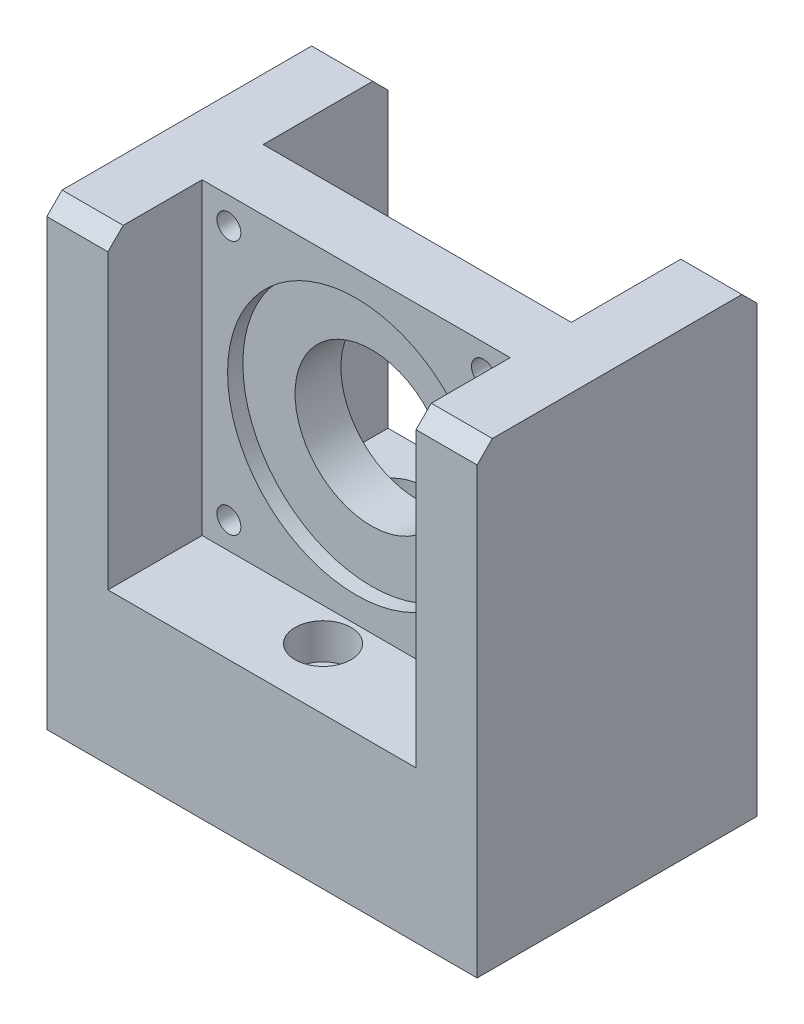
ISO-10303-21;
HEADER;
FILE_DESCRIPTION(('STEP AP214'),'2;1');
FILE_NAME('part.step','',(''),(''),'','','');
FILE_SCHEMA(('AUTOMOTIVE_DESIGN { 1 0 10303 214 1 1 1 1 }'));
ENDSEC;
DATA;
#1=APPLICATION_CONTEXT('core data for automotive mechanical design processes');
#2=APPLICATION_PROTOCOL_DEFINITION('international standard','automotive_design',2000,#1);
#3=PRODUCT_CONTEXT('',#1,'mechanical');
#4=PRODUCT('Part','Part','',(#3));
#5=PRODUCT_RELATED_PRODUCT_CATEGORY('part','',(#4));
#6=PRODUCT_DEFINITION_FORMATION('','',#4);
#7=PRODUCT_DEFINITION_CONTEXT('part definition',#1,'design');
#8=PRODUCT_DEFINITION('design','',#6,#7);
#9=PRODUCT_DEFINITION_SHAPE('','',#8);
#10=(LENGTH_UNIT() NAMED_UNIT(*) SI_UNIT(.MILLI.,.METRE.));
#11=(NAMED_UNIT(*) PLANE_ANGLE_UNIT() SI_UNIT($,.RADIAN.));
#12=(NAMED_UNIT(*) SI_UNIT($,.STERADIAN.) SOLID_ANGLE_UNIT());
#13=UNCERTAINTY_MEASURE_WITH_UNIT(LENGTH_MEASURE(1.E-05),#10,'distance_accuracy_value','');
#14=(GEOMETRIC_REPRESENTATION_CONTEXT(3) GLOBAL_UNCERTAINTY_ASSIGNED_CONTEXT((#13)) GLOBAL_UNIT_ASSIGNED_CONTEXT((#10,
#11,#12)) REPRESENTATION_CONTEXT('',''));
#15=CARTESIAN_POINT('',(0.,0.,0.));
#16=DIRECTION('',(0.,0.,1.));
#17=DIRECTION('',(1.,0.,0.));
#18=AXIS2_PLACEMENT_3D('',#15,#16,#17);
#19=CARTESIAN_POINT('',(17.5,-60.,-18.5));
#20=DIRECTION('',(0.,1.,0.));
#21=DIRECTION('',(-1.,0.,0.));
#22=AXIS2_PLACEMENT_3D('',#19,#20,#21);
#23=CYLINDRICAL_SURFACE('',#22,3.05);
#24=CARTESIAN_POINT('',(17.5,-60.,-18.5));
#25=DIRECTION('',(0.,1.,0.));
#26=DIRECTION('',(1.,0.,0.));
#27=AXIS2_PLACEMENT_3D('',#24,#25,#26);
#28=CIRCLE('',#27,3.05);
#29=CARTESIAN_POINT('',(20.55,-60.,-18.5));
#30=VERTEX_POINT('',#29);
#31=EDGE_CURVE('E300',#30,#30,#28,.T.);
#32=ORIENTED_EDGE('',*,*,#31,.F.);
#33=EDGE_LOOP('',(#32));
#34=FACE_BOUND('',#33,.T.);
#35=CARTESIAN_POINT('',(17.5,-37.25,-18.5));
#36=DIRECTION('',(0.,1.,0.));
#37=DIRECTION('',(-1.,0.,0.));
#38=AXIS2_PLACEMENT_3D('',#35,#36,#37);
#39=CIRCLE('',#38,3.05);
#40=CARTESIAN_POINT('',(14.45,-37.25,-18.5));
#41=VERTEX_POINT('',#40);
#42=EDGE_CURVE('E45',#41,#41,#39,.F.);
#43=ORIENTED_EDGE('',*,*,#42,.F.);
#44=EDGE_LOOP('',(#43));
#45=FACE_BOUND('',#44,.T.);
#46=ADVANCED_FACE('F40',(#34,#45),#23,.F.);
#47=CARTESIAN_POINT('',(-17.5,-60.,-18.5));
#48=DIRECTION('',(0.,1.,0.));
#49=DIRECTION('',(-1.,0.,0.));
#50=AXIS2_PLACEMENT_3D('',#47,#48,#49);
#51=CYLINDRICAL_SURFACE('',#50,3.05);
#52=CARTESIAN_POINT('',(-17.5,-60.,-18.5));
#53=DIRECTION('',(0.,1.,0.));
#54=DIRECTION('',(-1.,0.,0.));
#55=AXIS2_PLACEMENT_3D('',#52,#53,#54);
#56=CIRCLE('',#55,3.05);
#57=CARTESIAN_POINT('',(-20.55,-60.,-18.5));
#58=VERTEX_POINT('',#57);
#59=EDGE_CURVE('E304',#58,#58,#56,.T.);
#60=ORIENTED_EDGE('',*,*,#59,.F.);
#61=EDGE_LOOP('',(#60));
#62=FACE_BOUND('',#61,.T.);
#63=CARTESIAN_POINT('',(-17.5,-37.25,-18.5));
#64=DIRECTION('',(0.,1.,0.));
#65=DIRECTION('',(-1.,0.,0.));
#66=AXIS2_PLACEMENT_3D('',#63,#64,#65);
#67=CIRCLE('',#66,3.05);
#68=CARTESIAN_POINT('',(-20.55,-37.25,-18.5));
#69=VERTEX_POINT('',#68);
#70=EDGE_CURVE('E294',#69,#69,#67,.F.);
#71=ORIENTED_EDGE('',*,*,#70,.F.);
#72=EDGE_LOOP('',(#71));
#73=FACE_BOUND('',#72,.T.);
#74=ADVANCED_FACE('F415',(#62,#73),#51,.F.);
#75=CARTESIAN_POINT('',(0.,-60.,12.5));
#76=DIRECTION('',(0.,1.,0.));
#77=DIRECTION('',(-1.,0.,0.));
#78=AXIS2_PLACEMENT_3D('',#75,#76,#77);
#79=CYLINDRICAL_SURFACE('',#78,3.05);
#80=CARTESIAN_POINT('',(0.,-60.,12.5));
#81=DIRECTION('',(0.,1.,0.));
#82=DIRECTION('',(-1.,0.,0.));
#83=AXIS2_PLACEMENT_3D('',#80,#81,#82);
#84=CIRCLE('',#83,3.05);
#85=CARTESIAN_POINT('',(-3.04999999999999,-60.,12.5));
#86=VERTEX_POINT('',#85);
#87=EDGE_CURVE('E166',#86,#86,#84,.T.);
#88=ORIENTED_EDGE('',*,*,#87,.F.);
#89=EDGE_LOOP('',(#88));
#90=FACE_BOUND('',#89,.T.);
#91=CARTESIAN_POINT('',(0.,-37.25,12.5));
#92=DIRECTION('',(0.,1.,0.));
#93=DIRECTION('',(-1.,0.,0.));
#94=AXIS2_PLACEMENT_3D('',#91,#92,#93);
#95=CIRCLE('',#94,3.05);
#96=CARTESIAN_POINT('',(-3.05,-37.25,12.5));
#97=VERTEX_POINT('',#96);
#98=EDGE_CURVE('E292',#97,#97,#95,.F.);
#99=ORIENTED_EDGE('',*,*,#98,.F.);
#100=EDGE_LOOP('',(#99));
#101=FACE_BOUND('',#100,.T.);
#102=ADVANCED_FACE('F421',(#90,#101),#79,.F.);
#103=CARTESIAN_POINT('',(0.,-30.25,0.));
#104=DIRECTION('',(0.,-1.,0.));
#105=DIRECTION('',(1.,0.,0.));
#106=AXIS2_PLACEMENT_3D('',#103,#104,#105);
#107=PLANE('',#106);
#108=CARTESIAN_POINT('',(0.,-30.25,12.5));
#109=DIRECTION('',(0.,1.,0.));
#110=DIRECTION('',(-1.,0.,0.));
#111=AXIS2_PLACEMENT_3D('',#108,#109,#110);
#112=CIRCLE('',#111,5.5);
#113=CARTESIAN_POINT('',(-5.5,-30.25,12.5));
#114=VERTEX_POINT('',#113);
#115=EDGE_CURVE('E504',#114,#114,#112,.T.);
#116=ORIENTED_EDGE('',*,*,#115,.F.);
#117=EDGE_LOOP('',(#116));
#118=FACE_BOUND('',#117,.T.);
#119=DIRECTION('',(0.,0.,1.));
#120=VECTOR('',#119,1.);
#121=CARTESIAN_POINT('',(-30.25,-30.25,-30.5));
#122=LINE('',#121,#120);
#123=CARTESIAN_POINT('',(-30.25,-30.25,6.));
#124=VERTEX_POINT('',#123);
#125=CARTESIAN_POINT('',(-30.25,-30.25,24.5));
#126=VERTEX_POINT('',#125);
#127=EDGE_CURVE('E165',#124,#126,#122,.T.);
#128=ORIENTED_EDGE('',*,*,#127,.T.);
#129=DIRECTION('',(-1.,0.,0.));
#130=VECTOR('',#129,1.);
#131=CARTESIAN_POINT('',(-42.25,-30.25,24.5));
#132=LINE('',#131,#130);
#133=CARTESIAN_POINT('',(30.25,-30.25,24.5));
#134=VERTEX_POINT('',#133);
#135=EDGE_CURVE('E181',#134,#126,#132,.T.);
#136=ORIENTED_EDGE('',*,*,#135,.F.);
#137=DIRECTION('',(0.,0.,-1.));
#138=VECTOR('',#137,1.);
#139=CARTESIAN_POINT('',(30.25,-30.25,24.5));
#140=LINE('',#139,#138);
#141=CARTESIAN_POINT('',(30.25,-30.25,6.));
#142=VERTEX_POINT('',#141);
#143=EDGE_CURVE('E321',#134,#142,#140,.T.);
#144=ORIENTED_EDGE('',*,*,#143,.T.);
#145=DIRECTION('',(1.,0.,0.));
#146=VECTOR('',#145,1.);
#147=CARTESIAN_POINT('',(30.25,-30.25,6.));
#148=LINE('',#147,#146);
#149=EDGE_CURVE('E242',#124,#142,#148,.T.);
#150=ORIENTED_EDGE('',*,*,#149,.F.);
#151=EDGE_LOOP('',(#128,#136,#144,#150));
#152=FACE_BOUND('',#151,.T.);
#153=ADVANCED_FACE('F383',(#118,#152),#107,.F.);
#154=CARTESIAN_POINT('',(-17.5,-30.25,-18.5));
#155=DIRECTION('',(0.,1.,0.));
#156=DIRECTION('',(-1.,0.,0.));
#157=AXIS2_PLACEMENT_3D('',#154,#155,#156);
#158=CIRCLE('',#157,5.5);
#159=CARTESIAN_POINT('',(-23.,-30.25,-18.5));
#160=VERTEX_POINT('',#159);
#161=EDGE_CURVE('E493',#160,#160,#158,.T.);
#162=ORIENTED_EDGE('',*,*,#161,.F.);
#163=EDGE_LOOP('',(#162));
#164=FACE_BOUND('',#163,.T.);
#165=CARTESIAN_POINT('',(17.5,-30.25,-18.5));
#166=DIRECTION('',(0.,1.,0.));
#167=DIRECTION('',(-1.,0.,0.));
#168=AXIS2_PLACEMENT_3D('',#165,#166,#167);
#169=CIRCLE('',#168,5.5);
#170=CARTESIAN_POINT('',(12.,-30.25,-18.5));
#171=VERTEX_POINT('',#170);
#172=EDGE_CURVE('E496',#171,#171,#169,.T.);
#173=ORIENTED_EDGE('',*,*,#172,.F.);
#174=EDGE_LOOP('',(#173));
#175=FACE_BOUND('',#174,.T.);
#176=CARTESIAN_POINT('',(-30.25,-30.25,-30.5));
#177=VERTEX_POINT('',#176);
#178=CARTESIAN_POINT('',(-30.25,-30.25,-6.));
#179=VERTEX_POINT('',#178);
#180=EDGE_CURVE('E169',#177,#179,#122,.T.);
#181=ORIENTED_EDGE('',*,*,#180,.T.);
#182=DIRECTION('',(1.,0.,0.));
#183=VECTOR('',#182,1.);
#184=CARTESIAN_POINT('',(30.25,-30.25,-6.));
#185=LINE('',#184,#183);
#186=CARTESIAN_POINT('',(30.25,-30.25,-6.));
#187=VERTEX_POINT('',#186);
#188=EDGE_CURVE('E254',#179,#187,#185,.T.);
#189=ORIENTED_EDGE('',*,*,#188,.T.);
#190=CARTESIAN_POINT('',(30.25,-30.25,-30.5));
#191=VERTEX_POINT('',#190);
#192=EDGE_CURVE('E180',#187,#191,#140,.T.);
#193=ORIENTED_EDGE('',*,*,#192,.T.);
#194=DIRECTION('',(1.,0.,0.));
#195=VECTOR('',#194,1.);
#196=CARTESIAN_POINT('',(-42.25,-30.25,-30.5));
#197=LINE('',#196,#195);
#198=EDGE_CURVE('E160',#177,#191,#197,.T.);
#199=ORIENTED_EDGE('',*,*,#198,.F.);
#200=EDGE_LOOP('',(#181,#189,#193,#199));
#201=FACE_BOUND('',#200,.T.);
#202=ADVANCED_FACE('F179',(#164,#175,#201),#107,.F.);
#203=CARTESIAN_POINT('',(0.,0.,6.));
#204=DIRECTION('',(0.,0.,-1.));
#205=DIRECTION('',(-1.,0.,0.));
#206=AXIS2_PLACEMENT_3D('',#203,#204,#205);
#207=CYLINDRICAL_SURFACE('',#206,15.);
#208=CARTESIAN_POINT('',(0.,0.,-6.));
#209=DIRECTION('',(0.,0.,1.));
#210=DIRECTION('',(1.,0.,0.));
#211=AXIS2_PLACEMENT_3D('',#208,#209,#210);
#212=CIRCLE('',#211,15.);
#213=CARTESIAN_POINT('',(15.,0.,-6.));
#214=VERTEX_POINT('',#213);
#215=EDGE_CURVE('E234',#214,#214,#212,.T.);
#216=ORIENTED_EDGE('',*,*,#215,.F.);
#217=EDGE_LOOP('',(#216));
#218=FACE_BOUND('',#217,.T.);
#219=CARTESIAN_POINT('',(0.,0.,3.));
#220=DIRECTION('',(0.,0.,1.));
#221=DIRECTION('',(1.,0.,0.));
#222=AXIS2_PLACEMENT_3D('',#219,#220,#221);
#223=CIRCLE('',#222,15.);
#224=CARTESIAN_POINT('',(15.,0.,3.));
#225=VERTEX_POINT('',#224);
#226=EDGE_CURVE('E209',#225,#225,#223,.T.);
#227=ORIENTED_EDGE('',*,*,#226,.T.);
#228=EDGE_LOOP('',(#227));
#229=FACE_BOUND('',#228,.T.);
#230=ADVANCED_FACE('F392',(#218,#229),#207,.F.);
#231=CARTESIAN_POINT('',(0.,0.,6.));
#232=DIRECTION('',(0.,0.,1.));
#233=DIRECTION('',(1.,0.,0.));
#234=AXIS2_PLACEMENT_3D('',#231,#232,#233);
#235=PLANE('',#234);
#236=CARTESIAN_POINT('',(0.,0.,6.));
#237=DIRECTION('',(0.,0.,1.));
#238=DIRECTION('',(1.,0.,0.));
#239=AXIS2_PLACEMENT_3D('',#236,#237,#238);
#240=CIRCLE('',#239,25.25);
#241=CARTESIAN_POINT('',(25.25,0.,6.));
#242=VERTEX_POINT('',#241);
#243=EDGE_CURVE('E205',#242,#242,#240,.T.);
#244=ORIENTED_EDGE('',*,*,#243,.F.);
#245=EDGE_LOOP('',(#244));
#246=FACE_BOUND('',#245,.T.);
#247=CARTESIAN_POINT('',(25.,-25.,6.));
#248=DIRECTION('',(0.,0.,1.));
#249=DIRECTION('',(1.,0.,0.));
#250=AXIS2_PLACEMENT_3D('',#247,#248,#249);
#251=CIRCLE('',#250,2.35);
#252=CARTESIAN_POINT('',(27.35,-25.,6.));
#253=VERTEX_POINT('',#252);
#254=EDGE_CURVE('E219',#253,#253,#251,.T.);
#255=ORIENTED_EDGE('',*,*,#254,.F.);
#256=EDGE_LOOP('',(#255));
#257=FACE_BOUND('',#256,.T.);
#258=CARTESIAN_POINT('',(-25.,25.,6.));
#259=DIRECTION('',(0.,0.,1.));
#260=DIRECTION('',(1.,0.,0.));
#261=AXIS2_PLACEMENT_3D('',#258,#259,#260);
#262=CIRCLE('',#261,2.35);
#263=CARTESIAN_POINT('',(-22.65,25.,6.));
#264=VERTEX_POINT('',#263);
#265=EDGE_CURVE('E231',#264,#264,#262,.T.);
#266=ORIENTED_EDGE('',*,*,#265,.F.);
#267=EDGE_LOOP('',(#266));
#268=FACE_BOUND('',#267,.T.);
#269=DIRECTION('',(0.,-1.,0.));
#270=VECTOR('',#269,1.);
#271=CARTESIAN_POINT('',(-30.25,-30.25,6.));
#272=LINE('',#271,#270);
#273=CARTESIAN_POINT('',(-30.25,30.25,6.));
#274=VERTEX_POINT('',#273);
#275=EDGE_CURVE('E239',#274,#124,#272,.T.);
#276=ORIENTED_EDGE('',*,*,#275,.T.);
#277=ORIENTED_EDGE('',*,*,#149,.T.);
#278=DIRECTION('',(0.,1.,0.));
#279=VECTOR('',#278,1.);
#280=CARTESIAN_POINT('',(30.25,-30.25,6.));
#281=LINE('',#280,#279);
#282=CARTESIAN_POINT('',(30.25,30.25,6.));
#283=VERTEX_POINT('',#282);
#284=EDGE_CURVE('E246',#142,#283,#281,.T.);
#285=ORIENTED_EDGE('',*,*,#284,.T.);
#286=DIRECTION('',(-1.,0.,0.));
#287=VECTOR('',#286,1.);
#288=CARTESIAN_POINT('',(30.25,30.25,6.));
#289=LINE('',#288,#287);
#290=EDGE_CURVE('E249',#283,#274,#289,.T.);
#291=ORIENTED_EDGE('',*,*,#290,.T.);
#292=EDGE_LOOP('',(#276,#277,#285,#291));
#293=FACE_BOUND('',#292,.T.);
#294=CARTESIAN_POINT('',(25.,25.,6.));
#295=DIRECTION('',(0.,0.,1.));
#296=DIRECTION('',(1.,0.,0.));
#297=AXIS2_PLACEMENT_3D('',#294,#295,#296);
#298=CIRCLE('',#297,2.35);
#299=CARTESIAN_POINT('',(27.35,25.,6.));
#300=VERTEX_POINT('',#299);
#301=EDGE_CURVE('E225',#300,#300,#298,.T.);
#302=ORIENTED_EDGE('',*,*,#301,.F.);
#303=EDGE_LOOP('',(#302));
#304=FACE_BOUND('',#303,.T.);
#305=CARTESIAN_POINT('',(-25.,-25.,6.));
#306=DIRECTION('',(0.,0.,1.));
#307=DIRECTION('',(1.,0.,0.));
#308=AXIS2_PLACEMENT_3D('',#305,#306,#307);
#309=CIRCLE('',#308,2.35);
#310=CARTESIAN_POINT('',(-22.65,-25.,6.));
#311=VERTEX_POINT('',#310);
#312=EDGE_CURVE('E212',#311,#311,#309,.T.);
#313=ORIENTED_EDGE('',*,*,#312,.F.);
#314=EDGE_LOOP('',(#313));
#315=FACE_BOUND('',#314,.T.);
#316=ADVANCED_FACE('F389',(#246,#257,#268,#293,#304,#315),#235,.T.);
#317=CARTESIAN_POINT('',(0.,0.,-6.));
#318=DIRECTION('',(0.,0.,1.));
#319=DIRECTION('',(1.,0.,0.));
#320=AXIS2_PLACEMENT_3D('',#317,#318,#319);
#321=PLANE('',#320);
#322=DIRECTION('',(0.,-1.,0.));
#323=VECTOR('',#322,1.);
#324=CARTESIAN_POINT('',(-30.25,-30.25,-6.));
#325=LINE('',#324,#323);
#326=CARTESIAN_POINT('',(-30.25,30.25,-6.));
#327=VERTEX_POINT('',#326);
#328=EDGE_CURVE('E172',#327,#179,#325,.T.);
#329=ORIENTED_EDGE('',*,*,#328,.F.);
#330=DIRECTION('',(-1.,0.,0.));
#331=VECTOR('',#330,1.);
#332=CARTESIAN_POINT('',(30.25,30.25,-6.));
#333=LINE('',#332,#331);
#334=CARTESIAN_POINT('',(30.25,30.25,-6.));
#335=VERTEX_POINT('',#334);
#336=EDGE_CURVE('E243',#335,#327,#333,.T.);
#337=ORIENTED_EDGE('',*,*,#336,.F.);
#338=DIRECTION('',(0.,1.,0.));
#339=VECTOR('',#338,1.);
#340=CARTESIAN_POINT('',(30.25,-30.25,-6.));
#341=LINE('',#340,#339);
#342=EDGE_CURVE('E256',#187,#335,#341,.T.);
#343=ORIENTED_EDGE('',*,*,#342,.F.);
#344=ORIENTED_EDGE('',*,*,#188,.F.);
#345=EDGE_LOOP('',(#329,#337,#343,#344));
#346=FACE_BOUND('',#345,.T.);
#347=ORIENTED_EDGE('',*,*,#215,.T.);
#348=EDGE_LOOP('',(#347));
#349=FACE_BOUND('',#348,.T.);
#350=CARTESIAN_POINT('',(-25.,25.,-6.));
#351=DIRECTION('',(0.,0.,1.));
#352=DIRECTION('',(1.,0.,0.));
#353=AXIS2_PLACEMENT_3D('',#350,#351,#352);
#354=CIRCLE('',#353,2.35);
#355=CARTESIAN_POINT('',(-22.65,25.,-6.));
#356=VERTEX_POINT('',#355);
#357=EDGE_CURVE('E228',#356,#356,#354,.T.);
#358=ORIENTED_EDGE('',*,*,#357,.T.);
#359=EDGE_LOOP('',(#358));
#360=FACE_BOUND('',#359,.T.);
#361=CARTESIAN_POINT('',(25.,25.,-6.));
#362=DIRECTION('',(0.,0.,1.));
#363=DIRECTION('',(1.,0.,0.));
#364=AXIS2_PLACEMENT_3D('',#361,#362,#363);
#365=CIRCLE('',#364,2.35);
#366=CARTESIAN_POINT('',(27.35,25.,-6.));
#367=VERTEX_POINT('',#366);
#368=EDGE_CURVE('E222',#367,#367,#365,.T.);
#369=ORIENTED_EDGE('',*,*,#368,.T.);
#370=EDGE_LOOP('',(#369));
#371=FACE_BOUND('',#370,.T.);
#372=CARTESIAN_POINT('',(25.,-25.,-6.));
#373=DIRECTION('',(0.,0.,1.));
#374=DIRECTION('',(1.,0.,0.));
#375=AXIS2_PLACEMENT_3D('',#372,#373,#374);
#376=CIRCLE('',#375,2.35);
#377=CARTESIAN_POINT('',(27.35,-25.,-6.));
#378=VERTEX_POINT('',#377);
#379=EDGE_CURVE('E215',#378,#378,#376,.T.);
#380=ORIENTED_EDGE('',*,*,#379,.T.);
#381=EDGE_LOOP('',(#380));
#382=FACE_BOUND('',#381,.T.);
#383=CARTESIAN_POINT('',(-25.,-25.,-6.));
#384=DIRECTION('',(0.,0.,1.));
#385=DIRECTION('',(1.,0.,0.));
#386=AXIS2_PLACEMENT_3D('',#383,#384,#385);
#387=CIRCLE('',#386,2.35);
#388=CARTESIAN_POINT('',(-22.65,-25.,-6.));
#389=VERTEX_POINT('',#388);
#390=EDGE_CURVE('E216',#389,#389,#387,.T.);
#391=ORIENTED_EDGE('',*,*,#390,.T.);
#392=EDGE_LOOP('',(#391));
#393=FACE_BOUND('',#392,.T.);
#394=ADVANCED_FACE('F359',(#346,#349,#360,#371,#382,#393),#321,.F.);
#395=CARTESIAN_POINT('',(30.25,30.25,6.));
#396=DIRECTION('',(0.,-1.,0.));
#397=DIRECTION('',(1.,0.,0.));
#398=AXIS2_PLACEMENT_3D('',#395,#396,#397);
#399=PLANE('',#398);
#400=DIRECTION('',(0.,0.,-1.));
#401=VECTOR('',#400,1.);
#402=CARTESIAN_POINT('',(-30.25,30.25,-30.5));
#403=LINE('',#402,#401);
#404=CARTESIAN_POINT('',(-30.25,30.25,-27.5));
#405=VERTEX_POINT('',#404);
#406=EDGE_CURVE('E318',#327,#405,#403,.T.);
#407=ORIENTED_EDGE('',*,*,#406,.T.);
#408=DIRECTION('',(-1.,0.,0.));
#409=VECTOR('',#408,1.);
#410=CARTESIAN_POINT('',(30.25,30.25,-27.5));
#411=LINE('',#410,#409);
#412=CARTESIAN_POINT('',(-42.25,30.25,-27.5));
#413=VERTEX_POINT('',#412);
#414=EDGE_CURVE('E275',#405,#413,#411,.T.);
#415=ORIENTED_EDGE('',*,*,#414,.T.);
#416=DIRECTION('',(0.,0.,-1.));
#417=VECTOR('',#416,1.);
#418=CARTESIAN_POINT('',(-42.25,30.25,-30.5));
#419=LINE('',#418,#417);
#420=CARTESIAN_POINT('',(-42.25,30.25,21.5));
#421=VERTEX_POINT('',#420);
#422=EDGE_CURVE('E312',#421,#413,#419,.T.);
#423=ORIENTED_EDGE('',*,*,#422,.F.);
#424=DIRECTION('',(1.,0.,0.));
#425=VECTOR('',#424,1.);
#426=CARTESIAN_POINT('',(30.25,30.25,21.5));
#427=LINE('',#426,#425);
#428=CARTESIAN_POINT('',(-30.25,30.25,21.5));
#429=VERTEX_POINT('',#428);
#430=EDGE_CURVE('E267',#421,#429,#427,.T.);
#431=ORIENTED_EDGE('',*,*,#430,.T.);
#432=EDGE_CURVE('E315',#429,#274,#403,.T.);
#433=ORIENTED_EDGE('',*,*,#432,.T.);
#434=ORIENTED_EDGE('',*,*,#290,.F.);
#435=DIRECTION('',(0.,0.,1.));
#436=VECTOR('',#435,1.);
#437=CARTESIAN_POINT('',(30.25,30.25,24.5));
#438=LINE('',#437,#436);
#439=CARTESIAN_POINT('',(30.25,30.25,21.5));
#440=VERTEX_POINT('',#439);
#441=EDGE_CURVE('E326',#283,#440,#438,.T.);
#442=ORIENTED_EDGE('',*,*,#441,.T.);
#443=DIRECTION('',(1.,0.,0.));
#444=VECTOR('',#443,1.);
#445=CARTESIAN_POINT('',(30.25,30.25,21.5));
#446=LINE('',#445,#444);
#447=CARTESIAN_POINT('',(42.25,30.25,21.5));
#448=VERTEX_POINT('',#447);
#449=EDGE_CURVE('E270',#440,#448,#446,.T.);
#450=ORIENTED_EDGE('',*,*,#449,.T.);
#451=DIRECTION('',(0.,0.,1.));
#452=VECTOR('',#451,1.);
#453=CARTESIAN_POINT('',(42.25,30.25,24.5));
#454=LINE('',#453,#452);
#455=CARTESIAN_POINT('',(42.25,30.25,-27.5));
#456=VERTEX_POINT('',#455);
#457=EDGE_CURVE('E182',#456,#448,#454,.T.);
#458=ORIENTED_EDGE('',*,*,#457,.F.);
#459=DIRECTION('',(-1.,0.,0.));
#460=VECTOR('',#459,1.);
#461=CARTESIAN_POINT('',(30.25,30.25,-27.5));
#462=LINE('',#461,#460);
#463=CARTESIAN_POINT('',(30.25,30.25,-27.5));
#464=VERTEX_POINT('',#463);
#465=EDGE_CURVE('E272',#456,#464,#462,.T.);
#466=ORIENTED_EDGE('',*,*,#465,.T.);
#467=EDGE_CURVE('E188',#464,#335,#438,.T.);
#468=ORIENTED_EDGE('',*,*,#467,.T.);
#469=ORIENTED_EDGE('',*,*,#336,.T.);
#470=EDGE_LOOP('',(#407,#415,#423,#431,#433,#434,#442,#450,#458,#466,#468,#469));
#471=FACE_BOUND('',#470,.T.);
#472=ADVANCED_FACE('F353',(#471),#399,.F.);
#473=CARTESIAN_POINT('',(-25.,25.,6.));
#474=DIRECTION('',(0.,0.,-1.));
#475=DIRECTION('',(-1.,0.,0.));
#476=AXIS2_PLACEMENT_3D('',#473,#474,#475);
#477=CYLINDRICAL_SURFACE('',#476,2.35);
#478=ORIENTED_EDGE('',*,*,#265,.T.);
#479=EDGE_LOOP('',(#478));
#480=FACE_BOUND('',#479,.T.);
#481=ORIENTED_EDGE('',*,*,#357,.F.);
#482=EDGE_LOOP('',(#481));
#483=FACE_BOUND('',#482,.T.);
#484=ADVANCED_FACE('F412',(#480,#483),#477,.F.);
#485=CARTESIAN_POINT('',(25.,25.,6.));
#486=DIRECTION('',(0.,0.,-1.));
#487=DIRECTION('',(-1.,0.,0.));
#488=AXIS2_PLACEMENT_3D('',#485,#486,#487);
#489=CYLINDRICAL_SURFACE('',#488,2.35);
#490=ORIENTED_EDGE('',*,*,#301,.T.);
#491=EDGE_LOOP('',(#490));
#492=FACE_BOUND('',#491,.T.);
#493=ORIENTED_EDGE('',*,*,#368,.F.);
#494=EDGE_LOOP('',(#493));
#495=FACE_BOUND('',#494,.T.);
#496=ADVANCED_FACE('F454',(#492,#495),#489,.F.);
#497=CARTESIAN_POINT('',(25.,-25.,6.));
#498=DIRECTION('',(0.,0.,-1.));
#499=DIRECTION('',(-1.,0.,0.));
#500=AXIS2_PLACEMENT_3D('',#497,#498,#499);
#501=CYLINDRICAL_SURFACE('',#500,2.35);
#502=ORIENTED_EDGE('',*,*,#254,.T.);
#503=EDGE_LOOP('',(#502));
#504=FACE_BOUND('',#503,.T.);
#505=ORIENTED_EDGE('',*,*,#379,.F.);
#506=EDGE_LOOP('',(#505));
#507=FACE_BOUND('',#506,.T.);
#508=ADVANCED_FACE('F403',(#504,#507),#501,.F.);
#509=CARTESIAN_POINT('',(-25.,-25.,6.));
#510=DIRECTION('',(0.,0.,-1.));
#511=DIRECTION('',(-1.,0.,0.));
#512=AXIS2_PLACEMENT_3D('',#509,#510,#511);
#513=CYLINDRICAL_SURFACE('',#512,2.35);
#514=ORIENTED_EDGE('',*,*,#312,.T.);
#515=EDGE_LOOP('',(#514));
#516=FACE_BOUND('',#515,.T.);
#517=ORIENTED_EDGE('',*,*,#390,.F.);
#518=EDGE_LOOP('',(#517));
#519=FACE_BOUND('',#518,.T.);
#520=ADVANCED_FACE('F399',(#516,#519),#513,.F.);
#521=CARTESIAN_POINT('',(0.,0.,3.));
#522=DIRECTION('',(0.,0.,1.));
#523=DIRECTION('',(1.,0.,0.));
#524=AXIS2_PLACEMENT_3D('',#521,#522,#523);
#525=CYLINDRICAL_SURFACE('',#524,25.25);
#526=CARTESIAN_POINT('',(0.,0.,3.));
#527=DIRECTION('',(0.,0.,1.));
#528=DIRECTION('',(1.,0.,0.));
#529=AXIS2_PLACEMENT_3D('',#526,#527,#528);
#530=CIRCLE('',#529,25.25);
#531=CARTESIAN_POINT('',(25.25,0.,3.));
#532=VERTEX_POINT('',#531);
#533=EDGE_CURVE('E206',#532,#532,#530,.T.);
#534=ORIENTED_EDGE('',*,*,#533,.F.);
#535=EDGE_LOOP('',(#534));
#536=FACE_BOUND('',#535,.T.);
#537=ORIENTED_EDGE('',*,*,#243,.T.);
#538=EDGE_LOOP('',(#537));
#539=FACE_BOUND('',#538,.T.);
#540=ADVANCED_FACE('F402',(#536,#539),#525,.F.);
#541=CARTESIAN_POINT('',(0.,0.,3.));
#542=DIRECTION('',(0.,0.,1.));
#543=DIRECTION('',(1.,0.,0.));
#544=AXIS2_PLACEMENT_3D('',#541,#542,#543);
#545=PLANE('',#544);
#546=ORIENTED_EDGE('',*,*,#226,.F.);
#547=EDGE_LOOP('',(#546));
#548=FACE_BOUND('',#547,.T.);
#549=ORIENTED_EDGE('',*,*,#533,.T.);
#550=EDGE_LOOP('',(#549));
#551=FACE_BOUND('',#550,.T.);
#552=ADVANCED_FACE('F445',(#548,#551),#545,.T.);
#553=CARTESIAN_POINT('',(-42.25,-60.,24.5));
#554=DIRECTION('',(1.,0.,0.));
#555=DIRECTION('',(0.,1.,0.));
#556=AXIS2_PLACEMENT_3D('',#553,#554,#555);
#557=PLANE('',#556);
#558=ORIENTED_EDGE('',*,*,#422,.T.);
#559=DIRECTION('',(0.,0.707106781186546,0.707106781186549));
#560=VECTOR('',#559,1.);
#561=CARTESIAN_POINT('',(-42.25,27.25,-30.5));
#562=LINE('',#561,#560);
#563=CARTESIAN_POINT('',(-42.25,27.25,-30.5));
#564=VERTEX_POINT('',#563);
#565=EDGE_CURVE('E279',#413,#564,#562,.F.);
#566=ORIENTED_EDGE('',*,*,#565,.T.);
#567=DIRECTION('',(0.,1.,0.));
#568=VECTOR('',#567,1.);
#569=CARTESIAN_POINT('',(-42.25,-60.,-30.5));
#570=LINE('',#569,#568);
#571=CARTESIAN_POINT('',(-42.25,-60.,-30.5));
#572=VERTEX_POINT('',#571);
#573=EDGE_CURVE('E203',#572,#564,#570,.T.);
#574=ORIENTED_EDGE('',*,*,#573,.F.);
#575=DIRECTION('',(0.,0.,-1.));
#576=VECTOR('',#575,1.);
#577=CARTESIAN_POINT('',(-42.25,-60.,24.5));
#578=LINE('',#577,#576);
#579=CARTESIAN_POINT('',(-42.25,-60.,24.5));
#580=VERTEX_POINT('',#579);
#581=EDGE_CURVE('E185',#580,#572,#578,.T.);
#582=ORIENTED_EDGE('',*,*,#581,.F.);
#583=DIRECTION('',(0.,1.,0.));
#584=VECTOR('',#583,1.);
#585=CARTESIAN_POINT('',(-42.25,-60.,24.5));
#586=LINE('',#585,#584);
#587=CARTESIAN_POINT('',(-42.25,27.25,24.5));
#588=VERTEX_POINT('',#587);
#589=EDGE_CURVE('E194',#580,#588,#586,.T.);
#590=ORIENTED_EDGE('',*,*,#589,.T.);
#591=DIRECTION('',(0.,-0.707106781186549,0.707106781186546));
#592=VECTOR('',#591,1.);
#593=CARTESIAN_POINT('',(-42.25,30.25,21.5));
#594=LINE('',#593,#592);
#595=EDGE_CURVE('E277',#588,#421,#594,.F.);
#596=ORIENTED_EDGE('',*,*,#595,.T.);
#597=EDGE_LOOP('',(#558,#566,#574,#582,#590,#596));
#598=FACE_BOUND('',#597,.T.);
#599=ADVANCED_FACE('F345',(#598),#557,.F.);
#600=CARTESIAN_POINT('',(-42.25,-60.,-30.5));
#601=DIRECTION('',(0.,0.,1.));
#602=DIRECTION('',(1.,0.,0.));
#603=AXIS2_PLACEMENT_3D('',#600,#601,#602);
#604=PLANE('',#603);
#605=ORIENTED_EDGE('',*,*,#573,.T.);
#606=DIRECTION('',(1.,0.,0.));
#607=VECTOR('',#606,1.);
#608=CARTESIAN_POINT('',(-42.25,27.25,-30.5));
#609=LINE('',#608,#607);
#610=CARTESIAN_POINT('',(-30.25,27.25,-30.5));
#611=VERTEX_POINT('',#610);
#612=EDGE_CURVE('E163',#564,#611,#609,.T.);
#613=ORIENTED_EDGE('',*,*,#612,.T.);
#614=DIRECTION('',(0.,-1.,0.));
#615=VECTOR('',#614,1.);
#616=CARTESIAN_POINT('',(-30.25,30.25,-30.5));
#617=LINE('',#616,#615);
#618=EDGE_CURVE('E154',#611,#177,#617,.T.);
#619=ORIENTED_EDGE('',*,*,#618,.T.);
#620=ORIENTED_EDGE('',*,*,#198,.T.);
#621=DIRECTION('',(0.,1.,0.));
#622=VECTOR('',#621,1.);
#623=CARTESIAN_POINT('',(30.25,-30.25,-30.5));
#624=LINE('',#623,#622);
#625=CARTESIAN_POINT('',(30.25,27.25,-30.5));
#626=VERTEX_POINT('',#625);
#627=EDGE_CURVE('E324',#191,#626,#624,.T.);
#628=ORIENTED_EDGE('',*,*,#627,.T.);
#629=DIRECTION('',(1.,0.,0.));
#630=VECTOR('',#629,1.);
#631=CARTESIAN_POINT('',(-42.25,27.25,-30.5));
#632=LINE('',#631,#630);
#633=CARTESIAN_POINT('',(42.25,27.25,-30.5));
#634=VERTEX_POINT('',#633);
#635=EDGE_CURVE('E252',#626,#634,#632,.T.);
#636=ORIENTED_EDGE('',*,*,#635,.T.);
#637=DIRECTION('',(0.,1.,0.));
#638=VECTOR('',#637,1.);
#639=CARTESIAN_POINT('',(42.25,-60.,-30.5));
#640=LINE('',#639,#638);
#641=CARTESIAN_POINT('',(42.25,-60.,-30.5));
#642=VERTEX_POINT('',#641);
#643=EDGE_CURVE('E200',#642,#634,#640,.T.);
#644=ORIENTED_EDGE('',*,*,#643,.F.);
#645=DIRECTION('',(1.,0.,0.));
#646=VECTOR('',#645,1.);
#647=CARTESIAN_POINT('',(-42.25,-60.,-30.5));
#648=LINE('',#647,#646);
#649=EDGE_CURVE('E330',#572,#642,#648,.T.);
#650=ORIENTED_EDGE('',*,*,#649,.F.);
#651=EDGE_LOOP('',(#605,#613,#619,#620,#628,#636,#644,#650));
#652=FACE_BOUND('',#651,.T.);
#653=ADVANCED_FACE('F157',(#652),#604,.F.);
#654=CARTESIAN_POINT('',(42.25,-60.,24.5));
#655=DIRECTION('',(-1.,0.,0.));
#656=DIRECTION('',(0.,0.,1.));
#657=AXIS2_PLACEMENT_3D('',#654,#655,#656);
#658=PLANE('',#657);
#659=ORIENTED_EDGE('',*,*,#643,.T.);
#660=DIRECTION('',(0.,-0.707106781186549,-0.707106781186546));
#661=VECTOR('',#660,1.);
#662=CARTESIAN_POINT('',(42.25,30.25,-27.5));
#663=LINE('',#662,#661);
#664=EDGE_CURVE('E285',#634,#456,#663,.F.);
#665=ORIENTED_EDGE('',*,*,#664,.T.);
#666=ORIENTED_EDGE('',*,*,#457,.T.);
#667=DIRECTION('',(0.,0.707106781186547,-0.707106781186548));
#668=VECTOR('',#667,1.);
#669=CARTESIAN_POINT('',(42.25,27.25,24.5));
#670=LINE('',#669,#668);
#671=CARTESIAN_POINT('',(42.25,27.25,24.5));
#672=VERTEX_POINT('',#671);
#673=EDGE_CURVE('E283',#448,#672,#670,.F.);
#674=ORIENTED_EDGE('',*,*,#673,.T.);
#675=DIRECTION('',(0.,1.,0.));
#676=VECTOR('',#675,1.);
#677=CARTESIAN_POINT('',(42.25,-60.,24.5));
#678=LINE('',#677,#676);
#679=CARTESIAN_POINT('',(42.25,-60.,24.5));
#680=VERTEX_POINT('',#679);
#681=EDGE_CURVE('E197',#680,#672,#678,.T.);
#682=ORIENTED_EDGE('',*,*,#681,.F.);
#683=DIRECTION('',(0.,0.,1.));
#684=VECTOR('',#683,1.);
#685=CARTESIAN_POINT('',(42.25,-60.,24.5));
#686=LINE('',#685,#684);
#687=EDGE_CURVE('E331',#642,#680,#686,.T.);
#688=ORIENTED_EDGE('',*,*,#687,.F.);
#689=EDGE_LOOP('',(#659,#665,#666,#674,#682,#688));
#690=FACE_BOUND('',#689,.T.);
#691=ADVANCED_FACE('F370',(#690),#658,.F.);
#692=CARTESIAN_POINT('',(-42.25,-60.,24.5));
#693=DIRECTION('',(0.,0.,-1.));
#694=DIRECTION('',(-1.,0.,0.));
#695=AXIS2_PLACEMENT_3D('',#692,#693,#694);
#696=PLANE('',#695);
#697=ORIENTED_EDGE('',*,*,#681,.T.);
#698=DIRECTION('',(-1.,0.,0.));
#699=VECTOR('',#698,1.);
#700=CARTESIAN_POINT('',(-42.25,27.25,24.5));
#701=LINE('',#700,#699);
#702=CARTESIAN_POINT('',(30.25,27.25,24.5));
#703=VERTEX_POINT('',#702);
#704=EDGE_CURVE('E289',#672,#703,#701,.T.);
#705=ORIENTED_EDGE('',*,*,#704,.T.);
#706=DIRECTION('',(0.,-1.,0.));
#707=VECTOR('',#706,1.);
#708=CARTESIAN_POINT('',(30.25,-30.25,24.5));
#709=LINE('',#708,#707);
#710=EDGE_CURVE('E314',#703,#134,#709,.T.);
#711=ORIENTED_EDGE('',*,*,#710,.T.);
#712=ORIENTED_EDGE('',*,*,#135,.T.);
#713=DIRECTION('',(0.,1.,0.));
#714=VECTOR('',#713,1.);
#715=CARTESIAN_POINT('',(-30.25,30.25,24.5));
#716=LINE('',#715,#714);
#717=CARTESIAN_POINT('',(-30.25,27.25,24.5));
#718=VERTEX_POINT('',#717);
#719=EDGE_CURVE('E176',#126,#718,#716,.T.);
#720=ORIENTED_EDGE('',*,*,#719,.T.);
#721=DIRECTION('',(-1.,0.,0.));
#722=VECTOR('',#721,1.);
#723=CARTESIAN_POINT('',(-42.25,27.25,24.5));
#724=LINE('',#723,#722);
#725=EDGE_CURVE('E287',#718,#588,#724,.T.);
#726=ORIENTED_EDGE('',*,*,#725,.T.);
#727=ORIENTED_EDGE('',*,*,#589,.F.);
#728=DIRECTION('',(-1.,0.,0.));
#729=VECTOR('',#728,1.);
#730=CARTESIAN_POINT('',(-42.25,-60.,24.5));
#731=LINE('',#730,#729);
#732=EDGE_CURVE('E191',#680,#580,#731,.T.);
#733=ORIENTED_EDGE('',*,*,#732,.F.);
#734=EDGE_LOOP('',(#697,#705,#711,#712,#720,#726,#727,#733));
#735=FACE_BOUND('',#734,.T.);
#736=ADVANCED_FACE('F341',(#735),#696,.F.);
#737=CARTESIAN_POINT('',(0.,-60.,0.));
#738=DIRECTION('',(0.,-1.,0.));
#739=DIRECTION('',(1.,0.,0.));
#740=AXIS2_PLACEMENT_3D('',#737,#738,#739);
#741=PLANE('',#740);
#742=ORIENTED_EDGE('',*,*,#87,.T.);
#743=EDGE_LOOP('',(#742));
#744=FACE_BOUND('',#743,.T.);
#745=ORIENTED_EDGE('',*,*,#59,.T.);
#746=EDGE_LOOP('',(#745));
#747=FACE_BOUND('',#746,.T.);
#748=ORIENTED_EDGE('',*,*,#31,.T.);
#749=EDGE_LOOP('',(#748));
#750=FACE_BOUND('',#749,.T.);
#751=ORIENTED_EDGE('',*,*,#581,.T.);
#752=ORIENTED_EDGE('',*,*,#649,.T.);
#753=ORIENTED_EDGE('',*,*,#687,.T.);
#754=ORIENTED_EDGE('',*,*,#732,.T.);
#755=EDGE_LOOP('',(#751,#752,#753,#754));
#756=FACE_BOUND('',#755,.T.);
#757=ADVANCED_FACE('F337',(#744,#747,#750,#756),#741,.T.);
#758=CARTESIAN_POINT('',(30.25,0.,0.));
#759=DIRECTION('',(-1.,0.,0.));
#760=DIRECTION('',(0.,0.,1.));
#761=AXIS2_PLACEMENT_3D('',#758,#759,#760);
#762=PLANE('',#761);
#763=ORIENTED_EDGE('',*,*,#467,.F.);
#764=DIRECTION('',(0.,0.707106781186549,0.707106781186546));
#765=VECTOR('',#764,1.);
#766=CARTESIAN_POINT('',(30.25,28.8749999999999,-28.8750000000001));
#767=LINE('',#766,#765);
#768=EDGE_CURVE('E281',#464,#626,#767,.F.);
#769=ORIENTED_EDGE('',*,*,#768,.T.);
#770=ORIENTED_EDGE('',*,*,#627,.F.);
#771=ORIENTED_EDGE('',*,*,#192,.F.);
#772=ORIENTED_EDGE('',*,*,#342,.T.);
#773=EDGE_LOOP('',(#763,#769,#770,#771,#772));
#774=FACE_BOUND('',#773,.T.);
#775=ADVANCED_FACE('F362',(#774),#762,.T.);
#776=ORIENTED_EDGE('',*,*,#710,.F.);
#777=DIRECTION('',(0.,-0.707106781186547,0.707106781186548));
#778=VECTOR('',#777,1.);
#779=CARTESIAN_POINT('',(30.25,25.875,25.875));
#780=LINE('',#779,#778);
#781=EDGE_CURVE('E50',#703,#440,#780,.F.);
#782=ORIENTED_EDGE('',*,*,#781,.T.);
#783=ORIENTED_EDGE('',*,*,#441,.F.);
#784=ORIENTED_EDGE('',*,*,#284,.F.);
#785=ORIENTED_EDGE('',*,*,#143,.F.);
#786=EDGE_LOOP('',(#776,#782,#783,#784,#785));
#787=FACE_BOUND('',#786,.T.);
#788=ADVANCED_FACE('F378',(#787),#762,.T.);
#789=CARTESIAN_POINT('',(-30.25,0.,0.));
#790=DIRECTION('',(-1.,0.,0.));
#791=DIRECTION('',(0.,0.,1.));
#792=AXIS2_PLACEMENT_3D('',#789,#790,#791);
#793=PLANE('',#792);
#794=ORIENTED_EDGE('',*,*,#618,.F.);
#795=DIRECTION('',(0.,-0.707106781186546,-0.707106781186549));
#796=VECTOR('',#795,1.);
#797=CARTESIAN_POINT('',(-30.25,27.25,-30.5));
#798=LINE('',#797,#796);
#799=EDGE_CURVE('E265',#611,#405,#798,.F.);
#800=ORIENTED_EDGE('',*,*,#799,.T.);
#801=ORIENTED_EDGE('',*,*,#406,.F.);
#802=ORIENTED_EDGE('',*,*,#328,.T.);
#803=ORIENTED_EDGE('',*,*,#180,.F.);
#804=EDGE_LOOP('',(#794,#800,#801,#802,#803));
#805=FACE_BOUND('',#804,.T.);
#806=ADVANCED_FACE('F170',(#805),#793,.F.);
#807=ORIENTED_EDGE('',*,*,#432,.F.);
#808=DIRECTION('',(0.,0.707106781186549,-0.707106781186546));
#809=VECTOR('',#808,1.);
#810=CARTESIAN_POINT('',(-30.25,30.25,21.5));
#811=LINE('',#810,#809);
#812=EDGE_CURVE('E11',#429,#718,#811,.F.);
#813=ORIENTED_EDGE('',*,*,#812,.T.);
#814=ORIENTED_EDGE('',*,*,#719,.F.);
#815=ORIENTED_EDGE('',*,*,#127,.F.);
#816=ORIENTED_EDGE('',*,*,#275,.F.);
#817=EDGE_LOOP('',(#807,#813,#814,#815,#816));
#818=FACE_BOUND('',#817,.T.);
#819=ADVANCED_FACE('F387',(#818),#793,.F.);
#820=CARTESIAN_POINT('',(-42.25,27.25,-30.5));
#821=DIRECTION('',(0.,-0.707106781186549,0.707106781186546));
#822=DIRECTION('',(1.,0.,0.));
#823=AXIS2_PLACEMENT_3D('',#820,#821,#822);
#824=PLANE('',#823);
#825=ORIENTED_EDGE('',*,*,#565,.F.);
#826=ORIENTED_EDGE('',*,*,#414,.F.);
#827=ORIENTED_EDGE('',*,*,#799,.F.);
#828=ORIENTED_EDGE('',*,*,#612,.F.);
#829=EDGE_LOOP('',(#825,#826,#827,#828));
#830=FACE_BOUND('',#829,.T.);
#831=ADVANCED_FACE('F349',(#830),#824,.F.);
#832=CARTESIAN_POINT('',(30.25,30.25,-27.5));
#833=DIRECTION('',(0.,-0.707106781186546,0.707106781186549));
#834=DIRECTION('',(-1.,0.,0.));
#835=AXIS2_PLACEMENT_3D('',#832,#833,#834);
#836=PLANE('',#835);
#837=ORIENTED_EDGE('',*,*,#664,.F.);
#838=ORIENTED_EDGE('',*,*,#635,.F.);
#839=ORIENTED_EDGE('',*,*,#768,.F.);
#840=ORIENTED_EDGE('',*,*,#465,.F.);
#841=EDGE_LOOP('',(#837,#838,#839,#840));
#842=FACE_BOUND('',#841,.T.);
#843=ADVANCED_FACE('F366',(#842),#836,.F.);
#844=CARTESIAN_POINT('',(-42.25,27.25,24.5));
#845=DIRECTION('',(0.,-0.707106781186548,-0.707106781186547));
#846=DIRECTION('',(-1.,0.,0.));
#847=AXIS2_PLACEMENT_3D('',#844,#845,#846);
#848=PLANE('',#847);
#849=ORIENTED_EDGE('',*,*,#673,.F.);
#850=ORIENTED_EDGE('',*,*,#449,.F.);
#851=ORIENTED_EDGE('',*,*,#781,.F.);
#852=ORIENTED_EDGE('',*,*,#704,.F.);
#853=EDGE_LOOP('',(#849,#850,#851,#852));
#854=FACE_BOUND('',#853,.T.);
#855=ADVANCED_FACE('F374',(#854),#848,.F.);
#856=CARTESIAN_POINT('',(30.25,30.25,21.5));
#857=DIRECTION('',(0.,-0.707106781186546,-0.707106781186549));
#858=DIRECTION('',(1.,0.,0.));
#859=AXIS2_PLACEMENT_3D('',#856,#857,#858);
#860=PLANE('',#859);
#861=ORIENTED_EDGE('',*,*,#595,.F.);
#862=ORIENTED_EDGE('',*,*,#725,.F.);
#863=ORIENTED_EDGE('',*,*,#812,.F.);
#864=ORIENTED_EDGE('',*,*,#430,.F.);
#865=EDGE_LOOP('',(#861,#862,#863,#864));
#866=FACE_BOUND('',#865,.T.);
#867=ADVANCED_FACE('F43',(#866),#860,.F.);
#868=CARTESIAN_POINT('',(0.,-37.25,12.5));
#869=DIRECTION('',(0.,1.,0.));
#870=DIRECTION('',(-1.,0.,0.));
#871=AXIS2_PLACEMENT_3D('',#868,#869,#870);
#872=PLANE('',#871);
#873=CARTESIAN_POINT('',(0.,-37.25,12.5));
#874=DIRECTION('',(0.,1.,0.));
#875=DIRECTION('',(-1.,0.,0.));
#876=AXIS2_PLACEMENT_3D('',#873,#874,#875);
#877=CIRCLE('',#876,5.5);
#878=CARTESIAN_POINT('',(-5.5,-37.25,12.5));
#879=VERTEX_POINT('',#878);
#880=EDGE_CURVE('E499',#879,#879,#877,.T.);
#881=ORIENTED_EDGE('',*,*,#880,.T.);
#882=EDGE_LOOP('',(#881));
#883=FACE_BOUND('',#882,.T.);
#884=ORIENTED_EDGE('',*,*,#98,.T.);
#885=EDGE_LOOP('',(#884));
#886=FACE_BOUND('',#885,.T.);
#887=ADVANCED_FACE('F517',(#883,#886),#872,.T.);
#888=CARTESIAN_POINT('',(0.,-37.25,12.5));
#889=DIRECTION('',(0.,1.,0.));
#890=DIRECTION('',(-1.,0.,0.));
#891=AXIS2_PLACEMENT_3D('',#888,#889,#890);
#892=CYLINDRICAL_SURFACE('',#891,5.5);
#893=ORIENTED_EDGE('',*,*,#880,.F.);
#894=EDGE_LOOP('',(#893));
#895=FACE_BOUND('',#894,.T.);
#896=ORIENTED_EDGE('',*,*,#115,.T.);
#897=EDGE_LOOP('',(#896));
#898=FACE_BOUND('',#897,.T.);
#899=ADVANCED_FACE('F519',(#895,#898),#892,.F.);
#900=CARTESIAN_POINT('',(-17.5,-37.25,-18.5));
#901=DIRECTION('',(0.,1.,0.));
#902=DIRECTION('',(-1.,0.,0.));
#903=AXIS2_PLACEMENT_3D('',#900,#901,#902);
#904=PLANE('',#903);
#905=CARTESIAN_POINT('',(-17.5,-37.25,-18.5));
#906=DIRECTION('',(0.,1.,0.));
#907=DIRECTION('',(-1.,0.,0.));
#908=AXIS2_PLACEMENT_3D('',#905,#906,#907);
#909=CIRCLE('',#908,5.5);
#910=CARTESIAN_POINT('',(-23.,-37.25,-18.5));
#911=VERTEX_POINT('',#910);
#912=EDGE_CURVE('E295',#911,#911,#909,.T.);
#913=ORIENTED_EDGE('',*,*,#912,.T.);
#914=EDGE_LOOP('',(#913));
#915=FACE_BOUND('',#914,.T.);
#916=ORIENTED_EDGE('',*,*,#70,.T.);
#917=EDGE_LOOP('',(#916));
#918=FACE_BOUND('',#917,.T.);
#919=ADVANCED_FACE('F526',(#915,#918),#904,.T.);
#920=CARTESIAN_POINT('',(-17.5,-37.25,-18.5));
#921=DIRECTION('',(0.,1.,0.));
#922=DIRECTION('',(-1.,0.,0.));
#923=AXIS2_PLACEMENT_3D('',#920,#921,#922);
#924=CYLINDRICAL_SURFACE('',#923,5.5);
#925=ORIENTED_EDGE('',*,*,#912,.F.);
#926=EDGE_LOOP('',(#925));
#927=FACE_BOUND('',#926,.T.);
#928=ORIENTED_EDGE('',*,*,#161,.T.);
#929=EDGE_LOOP('',(#928));
#930=FACE_BOUND('',#929,.T.);
#931=ADVANCED_FACE('F537',(#927,#930),#924,.F.);
#932=CARTESIAN_POINT('',(17.5,-37.25,-18.5));
#933=DIRECTION('',(0.,1.,0.));
#934=DIRECTION('',(-1.,0.,0.));
#935=AXIS2_PLACEMENT_3D('',#932,#933,#934);
#936=PLANE('',#935);
#937=CARTESIAN_POINT('',(17.5,-37.25,-18.5));
#938=DIRECTION('',(0.,1.,0.));
#939=DIRECTION('',(-1.,0.,0.));
#940=AXIS2_PLACEMENT_3D('',#937,#938,#939);
#941=CIRCLE('',#940,5.5);
#942=CARTESIAN_POINT('',(12.,-37.25,-18.5));
#943=VERTEX_POINT('',#942);
#944=EDGE_CURVE('E498',#943,#943,#941,.T.);
#945=ORIENTED_EDGE('',*,*,#944,.T.);
#946=EDGE_LOOP('',(#945));
#947=FACE_BOUND('',#946,.T.);
#948=ORIENTED_EDGE('',*,*,#42,.T.);
#949=EDGE_LOOP('',(#948));
#950=FACE_BOUND('',#949,.T.);
#951=ADVANCED_FACE('F533',(#947,#950),#936,.T.);
#952=CARTESIAN_POINT('',(17.5,-37.25,-18.5));
#953=DIRECTION('',(0.,1.,0.));
#954=DIRECTION('',(-1.,0.,0.));
#955=AXIS2_PLACEMENT_3D('',#952,#953,#954);
#956=CYLINDRICAL_SURFACE('',#955,5.5);
#957=ORIENTED_EDGE('',*,*,#944,.F.);
#958=EDGE_LOOP('',(#957));
#959=FACE_BOUND('',#958,.T.);
#960=ORIENTED_EDGE('',*,*,#172,.T.);
#961=EDGE_LOOP('',(#960));
#962=FACE_BOUND('',#961,.T.);
#963=ADVANCED_FACE('F530',(#959,#962),#956,.F.);
#964=CLOSED_SHELL('',(#46,#74,#102,#153,#202,#230,#316,#394,#472,#484,#496,#508,#520,#540,#552,
#599,#653,#691,#736,#757,#775,#788,#806,#819,#831,#843,#855,#867,#887,#899,#919,#931,#951,#963));
#965=MANIFOLD_SOLID_BREP('B2',#964);
#966=ADVANCED_BREP_SHAPE_REPRESENTATION('',(#18,#965),#14);
#967=SHAPE_DEFINITION_REPRESENTATION(#9,#966);
ENDSEC;
END-ISO-10303-21;
